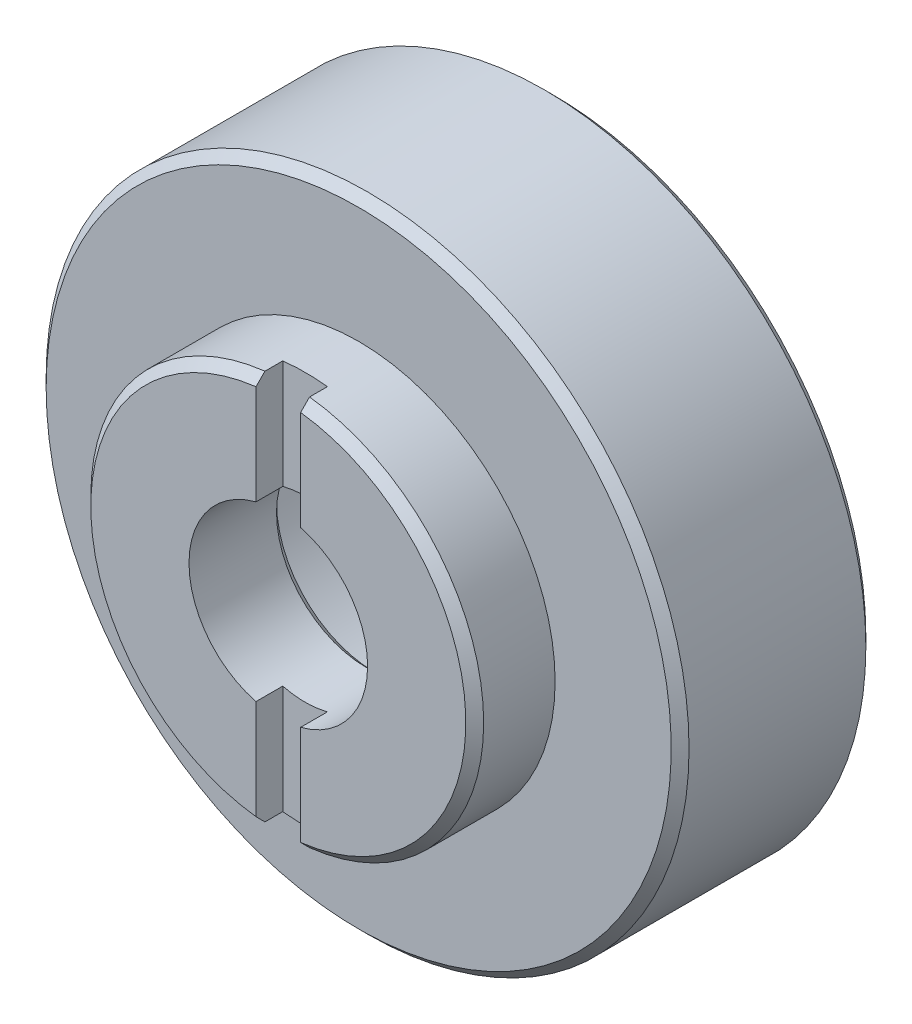
ISO-10303-21;
HEADER;
FILE_DESCRIPTION(('STEP AP214'),'2;1');
FILE_NAME('part.step','',(''),(''),'','','');
FILE_SCHEMA(('AUTOMOTIVE_DESIGN { 1 0 10303 214 1 1 1 1 }'));
ENDSEC;
DATA;
#1=APPLICATION_CONTEXT('core data for automotive mechanical design processes');
#2=APPLICATION_PROTOCOL_DEFINITION('international standard','automotive_design',2000,#1);
#3=PRODUCT_CONTEXT('',#1,'mechanical');
#4=PRODUCT('Part','Part','',(#3));
#5=PRODUCT_RELATED_PRODUCT_CATEGORY('part','',(#4));
#6=PRODUCT_DEFINITION_FORMATION('','',#4);
#7=PRODUCT_DEFINITION_CONTEXT('part definition',#1,'design');
#8=PRODUCT_DEFINITION('design','',#6,#7);
#9=PRODUCT_DEFINITION_SHAPE('','',#8);
#10=(LENGTH_UNIT() NAMED_UNIT(*) SI_UNIT(.MILLI.,.METRE.));
#11=(NAMED_UNIT(*) PLANE_ANGLE_UNIT() SI_UNIT($,.RADIAN.));
#12=(NAMED_UNIT(*) SI_UNIT($,.STERADIAN.) SOLID_ANGLE_UNIT());
#13=UNCERTAINTY_MEASURE_WITH_UNIT(LENGTH_MEASURE(1.E-05),#10,'distance_accuracy_value','');
#14=(GEOMETRIC_REPRESENTATION_CONTEXT(3) GLOBAL_UNCERTAINTY_ASSIGNED_CONTEXT((#13)) GLOBAL_UNIT_ASSIGNED_CONTEXT((#10,
#11,#12)) REPRESENTATION_CONTEXT('',''));
#15=CARTESIAN_POINT('',(0.,0.,0.));
#16=DIRECTION('',(0.,0.,1.));
#17=DIRECTION('',(1.,0.,0.));
#18=AXIS2_PLACEMENT_3D('',#15,#16,#17);
#19=CARTESIAN_POINT('',(0.,0.,0.));
#20=DIRECTION('',(0.,0.,-1.));
#21=DIRECTION('',(1.,0.,0.));
#22=AXIS2_PLACEMENT_3D('',#19,#20,#21);
#23=CONICAL_SURFACE('',#22,10.5,0.785398163397446);
#24=CARTESIAN_POINT('',(1.25,10.9287464971972,-0.5));
#25=CARTESIAN_POINT('',(1.25,10.7609668789126,-0.333307189488323));
#26=CARTESIAN_POINT('',(1.25,10.5931625311196,-0.166639264853283));
#27=CARTESIAN_POINT('',(1.25,10.4253297309965,0.));
#28=(BOUNDED_CURVE() B_SPLINE_CURVE(3,(#24,#25,#26,#27),.UNSPECIFIED.,.F.,
.F.) B_SPLINE_CURVE_WITH_KNOTS((4,4),(0.,0.00070952691315548),
.UNSPECIFIED.) CURVE() GEOMETRIC_REPRESENTATION_ITEM() RATIONAL_B_SPLINE_CURVE((1.,1.,1.,1.)) REPRESENTATION_ITEM(''));
#29=CARTESIAN_POINT('',(1.25,10.9287464971972,-0.5));
#30=VERTEX_POINT('',#29);
#31=CARTESIAN_POINT('',(1.25,10.4253297309965,0.));
#32=VERTEX_POINT('',#31);
#33=EDGE_CURVE('E336',#30,#32,#28,.T.);
#34=ORIENTED_EDGE('',*,*,#33,.T.);
#35=CARTESIAN_POINT('',(0.,0.,0.));
#36=DIRECTION('',(0.,0.,-1.));
#37=DIRECTION('',(-1.,0.,0.));
#38=AXIS2_PLACEMENT_3D('',#35,#36,#37);
#39=CIRCLE('',#38,10.5);
#40=CARTESIAN_POINT('',(1.25,-10.4253297309965,0.));
#41=VERTEX_POINT('',#40);
#42=EDGE_CURVE('E233',#32,#41,#39,.T.);
#43=ORIENTED_EDGE('',*,*,#42,.T.);
#44=CARTESIAN_POINT('',(1.25,-10.4253297309965,0.));
#45=CARTESIAN_POINT('',(1.25,-10.5931625311196,-0.166639264853283));
#46=CARTESIAN_POINT('',(1.25,-10.7609668789126,-0.333307189488323));
#47=CARTESIAN_POINT('',(1.25,-10.9287464971972,-0.5));
#48=(BOUNDED_CURVE() B_SPLINE_CURVE(3,(#44,#45,#46,#47),.UNSPECIFIED.,.F.,
.F.) B_SPLINE_CURVE_WITH_KNOTS((4,4),(0.,0.000709526913155479),
.UNSPECIFIED.) CURVE() GEOMETRIC_REPRESENTATION_ITEM() RATIONAL_B_SPLINE_CURVE((1.,1.,1.,1.)) REPRESENTATION_ITEM(''));
#49=CARTESIAN_POINT('',(1.25,-10.9287464971972,-0.5));
#50=VERTEX_POINT('',#49);
#51=EDGE_CURVE('E198',#41,#50,#48,.T.);
#52=ORIENTED_EDGE('',*,*,#51,.T.);
#53=CARTESIAN_POINT('',(0.,0.,-0.5));
#54=DIRECTION('',(0.,0.,1.));
#55=DIRECTION('',(-1.,0.,0.));
#56=AXIS2_PLACEMENT_3D('',#53,#54,#55);
#57=CIRCLE('',#56,11.);
#58=CARTESIAN_POINT('',(11.,0.,-0.5));
#59=VERTEX_POINT('',#58);
#60=EDGE_CURVE('E191',#50,#59,#57,.T.);
#61=ORIENTED_EDGE('',*,*,#60,.T.);
#62=CARTESIAN_POINT('',(0.,0.,-0.5));
#63=DIRECTION('',(0.,0.,1.));
#64=DIRECTION('',(-1.,0.,0.));
#65=AXIS2_PLACEMENT_3D('',#62,#63,#64);
#66=CIRCLE('',#65,11.);
#67=EDGE_CURVE('E194',#59,#30,#66,.T.);
#68=ORIENTED_EDGE('',*,*,#67,.T.);
#69=EDGE_LOOP('',(#34,#43,#52,#61,#68));
#70=FACE_BOUND('',#69,.T.);
#71=ADVANCED_FACE('F16',(#70),#23,.T.);
#72=CARTESIAN_POINT('',(0.,0.,0.));
#73=DIRECTION('',(0.,0.,-1.));
#74=DIRECTION('',(-1.,0.,0.));
#75=AXIS2_PLACEMENT_3D('',#72,#73,#74);
#76=CONICAL_SURFACE('',#75,10.5,0.785398163397447);
#77=CARTESIAN_POINT('',(-1.25,-10.9287464971972,-0.5));
#78=CARTESIAN_POINT('',(-1.25,-10.7609668789126,-0.333307189488321));
#79=CARTESIAN_POINT('',(-1.25,-10.5931625311196,-0.166639264853283));
#80=CARTESIAN_POINT('',(-1.25,-10.4253297309965,0.));
#81=(BOUNDED_CURVE() B_SPLINE_CURVE(3,(#77,#78,#79,#80),.UNSPECIFIED.,.F.,
.F.) B_SPLINE_CURVE_WITH_KNOTS((4,4),(0.,0.000709526913155476),
.UNSPECIFIED.) CURVE() GEOMETRIC_REPRESENTATION_ITEM() RATIONAL_B_SPLINE_CURVE((1.,1.,1.,1.)) REPRESENTATION_ITEM(''));
#82=CARTESIAN_POINT('',(-1.25,-10.9287464971972,-0.5));
#83=VERTEX_POINT('',#82);
#84=CARTESIAN_POINT('',(-1.25,-10.4253297309965,0.));
#85=VERTEX_POINT('',#84);
#86=EDGE_CURVE('E290',#83,#85,#81,.T.);
#87=ORIENTED_EDGE('',*,*,#86,.T.);
#88=CARTESIAN_POINT('',(0.,0.,0.));
#89=DIRECTION('',(0.,0.,-1.));
#90=DIRECTION('',(-1.,0.,0.));
#91=AXIS2_PLACEMENT_3D('',#88,#89,#90);
#92=CIRCLE('',#91,10.5);
#93=CARTESIAN_POINT('',(-1.25,10.4253297309965,0.));
#94=VERTEX_POINT('',#93);
#95=EDGE_CURVE('E363',#85,#94,#92,.T.);
#96=ORIENTED_EDGE('',*,*,#95,.T.);
#97=CARTESIAN_POINT('',(-1.25,10.4253297309965,0.));
#98=CARTESIAN_POINT('',(-1.25,10.5931625311196,-0.166639264853282));
#99=CARTESIAN_POINT('',(-1.25,10.7609668789126,-0.333307189488321));
#100=CARTESIAN_POINT('',(-1.25,10.9287464971972,-0.5));
#101=(BOUNDED_CURVE() B_SPLINE_CURVE(3,(#97,#98,#99,#100),.UNSPECIFIED.,.F.,
.F.) B_SPLINE_CURVE_WITH_KNOTS((4,4),(0.,0.000709526913155474),
.UNSPECIFIED.) CURVE() GEOMETRIC_REPRESENTATION_ITEM() RATIONAL_B_SPLINE_CURVE((1.,1.,1.,1.)) REPRESENTATION_ITEM(''));
#102=CARTESIAN_POINT('',(-1.25,10.9287464971972,-0.5));
#103=VERTEX_POINT('',#102);
#104=EDGE_CURVE('E318',#94,#103,#101,.T.);
#105=ORIENTED_EDGE('',*,*,#104,.T.);
#106=CARTESIAN_POINT('',(0.,0.,-0.5));
#107=DIRECTION('',(0.,0.,1.));
#108=DIRECTION('',(-1.,0.,0.));
#109=AXIS2_PLACEMENT_3D('',#106,#107,#108);
#110=CIRCLE('',#109,11.);
#111=EDGE_CURVE('E279',#103,#83,#110,.T.);
#112=ORIENTED_EDGE('',*,*,#111,.T.);
#113=EDGE_LOOP('',(#87,#96,#105,#112));
#114=FACE_BOUND('',#113,.T.);
#115=ADVANCED_FACE('F413',(#114),#76,.T.);
#116=CARTESIAN_POINT('',(0.,0.,-4.5));
#117=DIRECTION('',(0.,0.,-1.));
#118=DIRECTION('',(1.,0.,0.));
#119=AXIS2_PLACEMENT_3D('',#116,#117,#118);
#120=CONICAL_SURFACE('',#119,17.5,0.785398163397452);
#121=CARTESIAN_POINT('',(0.,0.,-5.));
#122=DIRECTION('',(0.,0.,1.));
#123=DIRECTION('',(-1.,0.,0.));
#124=AXIS2_PLACEMENT_3D('',#121,#122,#123);
#125=CIRCLE('',#124,18.);
#126=CARTESIAN_POINT('',(-18.,0.,-5.));
#127=VERTEX_POINT('',#126);
#128=CARTESIAN_POINT('',(18.,0.,-5.));
#129=VERTEX_POINT('',#128);
#130=EDGE_CURVE('E252',#127,#129,#125,.T.);
#131=ORIENTED_EDGE('',*,*,#130,.T.);
#132=CARTESIAN_POINT('',(0.,0.,-5.));
#133=DIRECTION('',(0.,0.,1.));
#134=DIRECTION('',(-1.,0.,0.));
#135=AXIS2_PLACEMENT_3D('',#132,#133,#134);
#136=CIRCLE('',#135,18.);
#137=EDGE_CURVE('E256',#129,#127,#136,.T.);
#138=ORIENTED_EDGE('',*,*,#137,.T.);
#139=DIRECTION('',(0.70710678118655,0.,0.707106781186545));
#140=VECTOR('',#139,1.);
#141=CARTESIAN_POINT('',(-17.5,0.,-4.5));
#142=LINE('',#141,#140);
#143=CARTESIAN_POINT('',(-17.5,0.,-4.5));
#144=VERTEX_POINT('',#143);
#145=EDGE_CURVE('E11',#127,#144,#142,.T.);
#146=ORIENTED_EDGE('',*,*,#145,.T.);
#147=CARTESIAN_POINT('',(0.,0.,-4.5));
#148=DIRECTION('',(0.,0.,-1.));
#149=DIRECTION('',(-1.,0.,0.));
#150=AXIS2_PLACEMENT_3D('',#147,#148,#149);
#151=CIRCLE('',#150,17.5);
#152=EDGE_CURVE('E257',#144,#144,#151,.T.);
#153=ORIENTED_EDGE('',*,*,#152,.T.);
#154=ORIENTED_EDGE('',*,*,#145,.F.);
#155=EDGE_LOOP('',(#131,#138,#146,#153,#154));
#156=FACE_BOUND('',#155,.T.);
#157=ADVANCED_FACE('F498',(#156),#120,.T.);
#158=CARTESIAN_POINT('',(0.,0.,-14.9));
#159=DIRECTION('',(0.,0.,1.));
#160=DIRECTION('',(-1.,0.,0.));
#161=AXIS2_PLACEMENT_3D('',#158,#159,#160);
#162=CONICAL_SURFACE('',#161,18.,0.785398163397452);
#163=CARTESIAN_POINT('',(0.,0.,-14.9));
#164=DIRECTION('',(0.,0.,-1.));
#165=DIRECTION('',(1.,0.,0.));
#166=AXIS2_PLACEMENT_3D('',#163,#164,#165);
#167=CIRCLE('',#166,18.);
#168=CARTESIAN_POINT('',(18.,0.,-14.9));
#169=VERTEX_POINT('',#168);
#170=EDGE_CURVE('E345',#169,#169,#167,.T.);
#171=ORIENTED_EDGE('',*,*,#170,.T.);
#172=DIRECTION('',(-0.70710678118655,0.,-0.707106781186545));
#173=VECTOR('',#172,1.);
#174=CARTESIAN_POINT('',(18.,0.,-14.9));
#175=LINE('',#174,#173);
#176=CARTESIAN_POINT('',(17.5,0.,-15.4));
#177=VERTEX_POINT('',#176);
#178=EDGE_CURVE('E27',#169,#177,#175,.T.);
#179=ORIENTED_EDGE('',*,*,#178,.T.);
#180=CARTESIAN_POINT('',(0.,0.,-15.4));
#181=DIRECTION('',(0.,0.,1.));
#182=DIRECTION('',(1.,0.,0.));
#183=AXIS2_PLACEMENT_3D('',#180,#181,#182);
#184=CIRCLE('',#183,17.5);
#185=EDGE_CURVE('E270',#177,#177,#184,.T.);
#186=ORIENTED_EDGE('',*,*,#185,.T.);
#187=ORIENTED_EDGE('',*,*,#178,.F.);
#188=EDGE_LOOP('',(#171,#179,#186,#187));
#189=FACE_BOUND('',#188,.T.);
#190=ADVANCED_FACE('F524',(#189),#162,.T.);
#191=CARTESIAN_POINT('',(0.,0.,-15.4));
#192=DIRECTION('',(0.,0.,-1.));
#193=DIRECTION('',(1.,0.,0.));
#194=AXIS2_PLACEMENT_3D('',#191,#192,#193);
#195=CONICAL_SURFACE('',#194,11.5,0.785398163397445);
#196=CARTESIAN_POINT('',(0.,0.,-14.9));
#197=DIRECTION('',(0.,0.,1.));
#198=DIRECTION('',(1.,0.,0.));
#199=AXIS2_PLACEMENT_3D('',#196,#197,#198);
#200=CIRCLE('',#199,11.);
#201=CARTESIAN_POINT('',(11.,0.,-14.9));
#202=VERTEX_POINT('',#201);
#203=CARTESIAN_POINT('',(-11.,0.,-14.9));
#204=VERTEX_POINT('',#203);
#205=EDGE_CURVE('E228',#202,#204,#200,.T.);
#206=ORIENTED_EDGE('',*,*,#205,.T.);
#207=DIRECTION('',(-0.707106781186545,0.,-0.70710678118655));
#208=VECTOR('',#207,1.);
#209=CARTESIAN_POINT('',(-11.5,0.,-15.4));
#210=LINE('',#209,#208);
#211=CARTESIAN_POINT('',(-11.5,0.,-15.4));
#212=VERTEX_POINT('',#211);
#213=EDGE_CURVE('E282',#204,#212,#210,.T.);
#214=ORIENTED_EDGE('',*,*,#213,.T.);
#215=CARTESIAN_POINT('',(0.,0.,-15.4));
#216=DIRECTION('',(0.,0.,-1.));
#217=DIRECTION('',(1.,0.,0.));
#218=AXIS2_PLACEMENT_3D('',#215,#216,#217);
#219=CIRCLE('',#218,11.5);
#220=CARTESIAN_POINT('',(11.5,0.,-15.4));
#221=VERTEX_POINT('',#220);
#222=EDGE_CURVE('E269',#212,#221,#219,.T.);
#223=ORIENTED_EDGE('',*,*,#222,.T.);
#224=CARTESIAN_POINT('',(0.,0.,-15.4));
#225=DIRECTION('',(0.,0.,-1.));
#226=DIRECTION('',(1.,0.,0.));
#227=AXIS2_PLACEMENT_3D('',#224,#225,#226);
#228=CIRCLE('',#227,11.5);
#229=EDGE_CURVE('E265',#221,#212,#228,.T.);
#230=ORIENTED_EDGE('',*,*,#229,.T.);
#231=ORIENTED_EDGE('',*,*,#213,.F.);
#232=CARTESIAN_POINT('',(0.,0.,-14.9));
#233=DIRECTION('',(0.,0.,1.));
#234=DIRECTION('',(1.,0.,0.));
#235=AXIS2_PLACEMENT_3D('',#232,#233,#234);
#236=CIRCLE('',#235,11.);
#237=EDGE_CURVE('E351',#204,#202,#236,.T.);
#238=ORIENTED_EDGE('',*,*,#237,.T.);
#239=EDGE_LOOP('',(#206,#214,#223,#230,#231,#238));
#240=FACE_BOUND('',#239,.T.);
#241=ADVANCED_FACE('F521',(#240),#195,.F.);
#242=CARTESIAN_POINT('',(0.,0.,-5.4));
#243=DIRECTION('',(0.,0.,-1.));
#244=DIRECTION('',(1.,0.,0.));
#245=AXIS2_PLACEMENT_3D('',#242,#243,#244);
#246=CONICAL_SURFACE('',#245,5.5,0.785398163397444);
#247=CARTESIAN_POINT('',(0.,0.,-4.9));
#248=DIRECTION('',(0.,0.,1.));
#249=DIRECTION('',(1.,0.,0.));
#250=AXIS2_PLACEMENT_3D('',#247,#248,#249);
#251=CIRCLE('',#250,5.);
#252=CARTESIAN_POINT('',(5.,0.,-4.9));
#253=VERTEX_POINT('',#252);
#254=CARTESIAN_POINT('',(-5.,0.,-4.9));
#255=VERTEX_POINT('',#254);
#256=EDGE_CURVE('E251',#253,#255,#251,.T.);
#257=ORIENTED_EDGE('',*,*,#256,.T.);
#258=DIRECTION('',(-0.707106781186544,0.,-0.707106781186551));
#259=VECTOR('',#258,1.);
#260=CARTESIAN_POINT('',(-5.5,0.,-5.4));
#261=LINE('',#260,#259);
#262=CARTESIAN_POINT('',(-5.5,0.,-5.4));
#263=VERTEX_POINT('',#262);
#264=EDGE_CURVE('E297',#255,#263,#261,.T.);
#265=ORIENTED_EDGE('',*,*,#264,.T.);
#266=CARTESIAN_POINT('',(0.,0.,-5.4));
#267=DIRECTION('',(0.,0.,-1.));
#268=DIRECTION('',(1.,0.,0.));
#269=AXIS2_PLACEMENT_3D('',#266,#267,#268);
#270=CIRCLE('',#269,5.5);
#271=CARTESIAN_POINT('',(5.5,0.,-5.4));
#272=VERTEX_POINT('',#271);
#273=EDGE_CURVE('E258',#263,#272,#270,.T.);
#274=ORIENTED_EDGE('',*,*,#273,.T.);
#275=CARTESIAN_POINT('',(0.,0.,-5.4));
#276=DIRECTION('',(0.,0.,-1.));
#277=DIRECTION('',(1.,0.,0.));
#278=AXIS2_PLACEMENT_3D('',#275,#276,#277);
#279=CIRCLE('',#278,5.5);
#280=EDGE_CURVE('E262',#272,#263,#279,.T.);
#281=ORIENTED_EDGE('',*,*,#280,.T.);
#282=ORIENTED_EDGE('',*,*,#264,.F.);
#283=CARTESIAN_POINT('',(0.,0.,-4.9));
#284=DIRECTION('',(0.,0.,1.));
#285=DIRECTION('',(1.,0.,0.));
#286=AXIS2_PLACEMENT_3D('',#283,#284,#285);
#287=CIRCLE('',#286,5.);
#288=EDGE_CURVE('E234',#255,#253,#287,.T.);
#289=ORIENTED_EDGE('',*,*,#288,.T.);
#290=EDGE_LOOP('',(#257,#265,#274,#281,#282,#289));
#291=FACE_BOUND('',#290,.T.);
#292=ADVANCED_FACE('F480',(#291),#246,.F.);
#293=CARTESIAN_POINT('',(0.,0.,-1.5));
#294=DIRECTION('',(0.,0.,-1.));
#295=DIRECTION('',(0.,-1.,0.));
#296=AXIS2_PLACEMENT_3D('',#293,#294,#295);
#297=PLANE('',#296);
#298=DIRECTION('',(0.,1.,0.));
#299=VECTOR('',#298,1.);
#300=CARTESIAN_POINT('',(-1.25,-10.9287464971972,-1.5));
#301=LINE('',#300,#299);
#302=CARTESIAN_POINT('',(-1.25,-10.9287464971972,-1.5));
#303=VERTEX_POINT('',#302);
#304=CARTESIAN_POINT('',(-1.25,-4.84122918275927,-1.5));
#305=VERTEX_POINT('',#304);
#306=EDGE_CURVE('E323',#303,#305,#301,.T.);
#307=ORIENTED_EDGE('',*,*,#306,.F.);
#308=CARTESIAN_POINT('',(0.,0.,-1.5));
#309=DIRECTION('',(0.,0.,1.));
#310=DIRECTION('',(-1.,0.,0.));
#311=AXIS2_PLACEMENT_3D('',#308,#309,#310);
#312=CIRCLE('',#311,11.);
#313=CARTESIAN_POINT('',(1.25,-10.9287464971972,-1.5));
#314=VERTEX_POINT('',#313);
#315=EDGE_CURVE('E349',#303,#314,#312,.T.);
#316=ORIENTED_EDGE('',*,*,#315,.T.);
#317=DIRECTION('',(0.,-1.,0.));
#318=VECTOR('',#317,1.);
#319=CARTESIAN_POINT('',(1.25,-4.84122918275927,-1.5));
#320=LINE('',#319,#318);
#321=CARTESIAN_POINT('',(1.25,-4.84122918275927,-1.5));
#322=VERTEX_POINT('',#321);
#323=EDGE_CURVE('E287',#322,#314,#320,.T.);
#324=ORIENTED_EDGE('',*,*,#323,.F.);
#325=CARTESIAN_POINT('',(0.,0.,-1.5));
#326=DIRECTION('',(0.,0.,1.));
#327=DIRECTION('',(-1.,0.,0.));
#328=AXIS2_PLACEMENT_3D('',#325,#326,#327);
#329=CIRCLE('',#328,5.);
#330=EDGE_CURVE('E286',#305,#322,#329,.T.);
#331=ORIENTED_EDGE('',*,*,#330,.F.);
#332=EDGE_LOOP('',(#307,#316,#324,#331));
#333=FACE_BOUND('',#332,.T.);
#334=ADVANCED_FACE('F403',(#333),#297,.F.);
#335=CARTESIAN_POINT('',(1.25,-4.84122918275927,-1.5));
#336=DIRECTION('',(-1.,0.,0.));
#337=DIRECTION('',(0.,0.,1.));
#338=AXIS2_PLACEMENT_3D('',#335,#336,#337);
#339=PLANE('',#338);
#340=DIRECTION('',(0.,-1.,0.));
#341=VECTOR('',#340,1.);
#342=CARTESIAN_POINT('',(1.25,-4.84122918275927,0.));
#343=LINE('',#342,#341);
#344=CARTESIAN_POINT('',(1.25,-4.84122918275927,0.));
#345=VERTEX_POINT('',#344);
#346=EDGE_CURVE('E242',#345,#41,#343,.T.);
#347=ORIENTED_EDGE('',*,*,#346,.F.);
#348=DIRECTION('',(0.,0.,1.));
#349=VECTOR('',#348,1.);
#350=CARTESIAN_POINT('',(1.25,-4.84122918275927,-1.5));
#351=LINE('',#350,#349);
#352=EDGE_CURVE('E283',#322,#345,#351,.T.);
#353=ORIENTED_EDGE('',*,*,#352,.F.);
#354=ORIENTED_EDGE('',*,*,#323,.T.);
#355=DIRECTION('',(0.,0.,-1.));
#356=VECTOR('',#355,1.);
#357=CARTESIAN_POINT('',(1.25,-10.9287464971972,-1.5));
#358=LINE('',#357,#356);
#359=EDGE_CURVE('E203',#50,#314,#358,.T.);
#360=ORIENTED_EDGE('',*,*,#359,.F.);
#361=ORIENTED_EDGE('',*,*,#51,.F.);
#362=EDGE_LOOP('',(#347,#353,#354,#360,#361));
#363=FACE_BOUND('',#362,.T.);
#364=ADVANCED_FACE('F398',(#363),#339,.T.);
#365=CARTESIAN_POINT('',(-1.25,-4.84122918275927,-1.5));
#366=DIRECTION('',(1.,0.,0.));
#367=DIRECTION('',(0.,0.,1.));
#368=AXIS2_PLACEMENT_3D('',#365,#366,#367);
#369=PLANE('',#368);
#370=DIRECTION('',(0.,0.,1.));
#371=VECTOR('',#370,1.);
#372=CARTESIAN_POINT('',(-1.25,-10.9287464971972,-1.5));
#373=LINE('',#372,#371);
#374=EDGE_CURVE('E346',#303,#83,#373,.T.);
#375=ORIENTED_EDGE('',*,*,#374,.F.);
#376=ORIENTED_EDGE('',*,*,#306,.T.);
#377=DIRECTION('',(0.,0.,1.));
#378=VECTOR('',#377,1.);
#379=CARTESIAN_POINT('',(-1.25,-4.84122918275927,-1.5));
#380=LINE('',#379,#378);
#381=CARTESIAN_POINT('',(-1.25,-4.84122918275927,0.));
#382=VERTEX_POINT('',#381);
#383=EDGE_CURVE('E339',#305,#382,#380,.T.);
#384=ORIENTED_EDGE('',*,*,#383,.T.);
#385=DIRECTION('',(0.,1.,0.));
#386=VECTOR('',#385,1.);
#387=CARTESIAN_POINT('',(-1.25,-10.4253297309965,0.));
#388=LINE('',#387,#386);
#389=EDGE_CURVE('E237',#85,#382,#388,.T.);
#390=ORIENTED_EDGE('',*,*,#389,.F.);
#391=ORIENTED_EDGE('',*,*,#86,.F.);
#392=EDGE_LOOP('',(#375,#376,#384,#390,#391));
#393=FACE_BOUND('',#392,.T.);
#394=ADVANCED_FACE('F408',(#393),#369,.T.);
#395=CARTESIAN_POINT('',(0.,0.,-1.5));
#396=DIRECTION('',(0.,0.,-1.));
#397=DIRECTION('',(0.,-1.,0.));
#398=AXIS2_PLACEMENT_3D('',#395,#396,#397);
#399=PLANE('',#398);
#400=DIRECTION('',(0.,-1.,0.));
#401=VECTOR('',#400,1.);
#402=CARTESIAN_POINT('',(1.25,10.9287464971972,-1.5));
#403=LINE('',#402,#401);
#404=CARTESIAN_POINT('',(1.25,10.9287464971972,-1.5));
#405=VERTEX_POINT('',#404);
#406=CARTESIAN_POINT('',(1.25,4.84122918275927,-1.5));
#407=VERTEX_POINT('',#406);
#408=EDGE_CURVE('E342',#405,#407,#403,.T.);
#409=ORIENTED_EDGE('',*,*,#408,.F.);
#410=CARTESIAN_POINT('',(0.,0.,-1.5));
#411=DIRECTION('',(0.,0.,1.));
#412=DIRECTION('',(-1.,0.,0.));
#413=AXIS2_PLACEMENT_3D('',#410,#411,#412);
#414=CIRCLE('',#413,11.);
#415=CARTESIAN_POINT('',(-1.25,10.9287464971972,-1.5));
#416=VERTEX_POINT('',#415);
#417=EDGE_CURVE('E224',#405,#416,#414,.T.);
#418=ORIENTED_EDGE('',*,*,#417,.T.);
#419=DIRECTION('',(0.,1.,0.));
#420=VECTOR('',#419,1.);
#421=CARTESIAN_POINT('',(-1.25,4.84122918275927,-1.5));
#422=LINE('',#421,#420);
#423=CARTESIAN_POINT('',(-1.25,4.84122918275927,-1.5));
#424=VERTEX_POINT('',#423);
#425=EDGE_CURVE('E324',#424,#416,#422,.T.);
#426=ORIENTED_EDGE('',*,*,#425,.F.);
#427=CARTESIAN_POINT('',(0.,0.,-1.5));
#428=DIRECTION('',(0.,0.,1.));
#429=DIRECTION('',(-1.,0.,0.));
#430=AXIS2_PLACEMENT_3D('',#427,#428,#429);
#431=CIRCLE('',#430,5.);
#432=EDGE_CURVE('E303',#407,#424,#431,.T.);
#433=ORIENTED_EDGE('',*,*,#432,.F.);
#434=EDGE_LOOP('',(#409,#418,#426,#433));
#435=FACE_BOUND('',#434,.T.);
#436=ADVANCED_FACE('F421',(#435),#399,.F.);
#437=CARTESIAN_POINT('',(-1.25,10.9409689664164,-1.5));
#438=DIRECTION('',(1.,0.,0.));
#439=DIRECTION('',(0.,0.,1.));
#440=AXIS2_PLACEMENT_3D('',#437,#438,#439);
#441=PLANE('',#440);
#442=DIRECTION('',(0.,1.,0.));
#443=VECTOR('',#442,1.);
#444=CARTESIAN_POINT('',(-1.25,4.84122918275927,0.));
#445=LINE('',#444,#443);
#446=CARTESIAN_POINT('',(-1.25,4.84122918275927,0.));
#447=VERTEX_POINT('',#446);
#448=EDGE_CURVE('E331',#447,#94,#445,.T.);
#449=ORIENTED_EDGE('',*,*,#448,.F.);
#450=DIRECTION('',(0.,0.,1.));
#451=VECTOR('',#450,1.);
#452=CARTESIAN_POINT('',(-1.25,4.84122918275927,-1.5));
#453=LINE('',#452,#451);
#454=EDGE_CURVE('E307',#424,#447,#453,.T.);
#455=ORIENTED_EDGE('',*,*,#454,.F.);
#456=ORIENTED_EDGE('',*,*,#425,.T.);
#457=DIRECTION('',(0.,0.,-1.));
#458=VECTOR('',#457,1.);
#459=CARTESIAN_POINT('',(-1.25,10.9287464971972,-1.5));
#460=LINE('',#459,#458);
#461=EDGE_CURVE('E230',#103,#416,#460,.T.);
#462=ORIENTED_EDGE('',*,*,#461,.F.);
#463=ORIENTED_EDGE('',*,*,#104,.F.);
#464=EDGE_LOOP('',(#449,#455,#456,#462,#463));
#465=FACE_BOUND('',#464,.T.);
#466=ADVANCED_FACE('F18',(#465),#441,.T.);
#467=CARTESIAN_POINT('',(1.25,10.9409689664164,-1.5));
#468=DIRECTION('',(-1.,0.,0.));
#469=DIRECTION('',(0.,0.,1.));
#470=AXIS2_PLACEMENT_3D('',#467,#468,#469);
#471=PLANE('',#470);
#472=DIRECTION('',(0.,0.,1.));
#473=VECTOR('',#472,1.);
#474=CARTESIAN_POINT('',(1.25,10.9287464971972,-1.5));
#475=LINE('',#474,#473);
#476=EDGE_CURVE('E217',#405,#30,#475,.T.);
#477=ORIENTED_EDGE('',*,*,#476,.F.);
#478=ORIENTED_EDGE('',*,*,#408,.T.);
#479=DIRECTION('',(0.,0.,1.));
#480=VECTOR('',#479,1.);
#481=CARTESIAN_POINT('',(1.25,4.84122918275927,-1.5));
#482=LINE('',#481,#480);
#483=CARTESIAN_POINT('',(1.25,4.84122918275927,0.));
#484=VERTEX_POINT('',#483);
#485=EDGE_CURVE('E308',#407,#484,#482,.T.);
#486=ORIENTED_EDGE('',*,*,#485,.T.);
#487=DIRECTION('',(0.,-1.,0.));
#488=VECTOR('',#487,1.);
#489=CARTESIAN_POINT('',(1.25,10.4253297309965,0.));
#490=LINE('',#489,#488);
#491=EDGE_CURVE('E162',#32,#484,#490,.T.);
#492=ORIENTED_EDGE('',*,*,#491,.F.);
#493=ORIENTED_EDGE('',*,*,#33,.F.);
#494=EDGE_LOOP('',(#477,#478,#486,#492,#493));
#495=FACE_BOUND('',#494,.T.);
#496=ADVANCED_FACE('F424',(#495),#471,.T.);
#497=CARTESIAN_POINT('',(0.,0.,0.));
#498=DIRECTION('',(0.,0.,-1.));
#499=DIRECTION('',(-1.,0.,0.));
#500=AXIS2_PLACEMENT_3D('',#497,#498,#499);
#501=CYLINDRICAL_SURFACE('',#500,18.);
#502=ORIENTED_EDGE('',*,*,#130,.F.);
#503=ORIENTED_EDGE('',*,*,#137,.F.);
#504=DIRECTION('',(0.,0.,-1.));
#505=VECTOR('',#504,1.);
#506=CARTESIAN_POINT('',(18.,0.,0.));
#507=LINE('',#506,#505);
#508=EDGE_CURVE('E20',#129,#169,#507,.T.);
#509=ORIENTED_EDGE('',*,*,#508,.T.);
#510=ORIENTED_EDGE('',*,*,#170,.F.);
#511=ORIENTED_EDGE('',*,*,#508,.F.);
#512=EDGE_LOOP('',(#502,#503,#509,#510,#511));
#513=FACE_BOUND('',#512,.T.);
#514=ADVANCED_FACE('F510',(#513),#501,.T.);
#515=CARTESIAN_POINT('',(-18.,0.,-4.5));
#516=DIRECTION('',(0.,0.,-1.));
#517=DIRECTION('',(0.,-1.,0.));
#518=AXIS2_PLACEMENT_3D('',#515,#516,#517);
#519=PLANE('',#518);
#520=CARTESIAN_POINT('',(0.,0.,-4.5));
#521=DIRECTION('',(0.,0.,-1.));
#522=DIRECTION('',(-1.,0.,0.));
#523=AXIS2_PLACEMENT_3D('',#520,#521,#522);
#524=CIRCLE('',#523,11.);
#525=CARTESIAN_POINT('',(-11.,0.,-4.5));
#526=VERTEX_POINT('',#525);
#527=CARTESIAN_POINT('',(11.,0.,-4.5));
#528=VERTEX_POINT('',#527);
#529=EDGE_CURVE('E213',#526,#528,#524,.T.);
#530=ORIENTED_EDGE('',*,*,#529,.T.);
#531=CARTESIAN_POINT('',(0.,0.,-4.5));
#532=DIRECTION('',(0.,0.,-1.));
#533=DIRECTION('',(-1.,0.,0.));
#534=AXIS2_PLACEMENT_3D('',#531,#532,#533);
#535=CIRCLE('',#534,11.);
#536=EDGE_CURVE('E204',#528,#526,#535,.T.);
#537=ORIENTED_EDGE('',*,*,#536,.T.);
#538=EDGE_LOOP('',(#530,#537));
#539=FACE_BOUND('',#538,.T.);
#540=ORIENTED_EDGE('',*,*,#152,.F.);
#541=EDGE_LOOP('',(#540));
#542=FACE_BOUND('',#541,.T.);
#543=ADVANCED_FACE('F508',(#539,#542),#519,.F.);
#544=CARTESIAN_POINT('',(0.,0.,0.));
#545=DIRECTION('',(0.,0.,-1.));
#546=DIRECTION('',(-1.,0.,0.));
#547=AXIS2_PLACEMENT_3D('',#544,#545,#546);
#548=CYLINDRICAL_SURFACE('',#547,11.);
#549=ORIENTED_EDGE('',*,*,#461,.T.);
#550=ORIENTED_EDGE('',*,*,#417,.F.);
#551=ORIENTED_EDGE('',*,*,#476,.T.);
#552=ORIENTED_EDGE('',*,*,#67,.F.);
#553=DIRECTION('',(0.,0.,-1.));
#554=VECTOR('',#553,1.);
#555=CARTESIAN_POINT('',(11.,0.,0.));
#556=LINE('',#555,#554);
#557=EDGE_CURVE('E207',#59,#528,#556,.T.);
#558=ORIENTED_EDGE('',*,*,#557,.T.);
#559=ORIENTED_EDGE('',*,*,#529,.F.);
#560=ORIENTED_EDGE('',*,*,#536,.F.);
#561=ORIENTED_EDGE('',*,*,#557,.F.);
#562=ORIENTED_EDGE('',*,*,#60,.F.);
#563=ORIENTED_EDGE('',*,*,#359,.T.);
#564=ORIENTED_EDGE('',*,*,#315,.F.);
#565=ORIENTED_EDGE('',*,*,#374,.T.);
#566=ORIENTED_EDGE('',*,*,#111,.F.);
#567=EDGE_LOOP('',(#549,#550,#551,#552,#558,#559,#560,#561,#562,#563,#564,#565,#566));
#568=FACE_BOUND('',#567,.T.);
#569=ADVANCED_FACE('F209',(#568),#548,.T.);
#570=CARTESIAN_POINT('',(-11.,0.,0.));
#571=DIRECTION('',(0.,0.,-1.));
#572=DIRECTION('',(0.,-1.,0.));
#573=AXIS2_PLACEMENT_3D('',#570,#571,#572);
#574=PLANE('',#573);
#575=ORIENTED_EDGE('',*,*,#491,.T.);
#576=CARTESIAN_POINT('',(0.,0.,0.));
#577=DIRECTION('',(0.,0.,-1.));
#578=DIRECTION('',(-1.,0.,0.));
#579=AXIS2_PLACEMENT_3D('',#576,#577,#578);
#580=CIRCLE('',#579,5.);
#581=CARTESIAN_POINT('',(5.,0.,0.));
#582=VERTEX_POINT('',#581);
#583=EDGE_CURVE('E250',#484,#582,#580,.T.);
#584=ORIENTED_EDGE('',*,*,#583,.T.);
#585=CARTESIAN_POINT('',(0.,0.,0.));
#586=DIRECTION('',(0.,0.,-1.));
#587=DIRECTION('',(-1.,0.,0.));
#588=AXIS2_PLACEMENT_3D('',#585,#586,#587);
#589=CIRCLE('',#588,5.);
#590=EDGE_CURVE('E174',#582,#345,#589,.T.);
#591=ORIENTED_EDGE('',*,*,#590,.T.);
#592=ORIENTED_EDGE('',*,*,#346,.T.);
#593=ORIENTED_EDGE('',*,*,#42,.F.);
#594=EDGE_LOOP('',(#575,#584,#591,#592,#593));
#595=FACE_BOUND('',#594,.T.);
#596=ADVANCED_FACE('F395',(#595),#574,.F.);
#597=CARTESIAN_POINT('',(0.,0.,0.));
#598=DIRECTION('',(0.,0.,-1.));
#599=DIRECTION('',(-1.,0.,0.));
#600=AXIS2_PLACEMENT_3D('',#597,#598,#599);
#601=CYLINDRICAL_SURFACE('',#600,5.);
#602=ORIENTED_EDGE('',*,*,#256,.F.);
#603=DIRECTION('',(0.,0.,1.));
#604=VECTOR('',#603,1.);
#605=CARTESIAN_POINT('',(5.,0.,0.));
#606=LINE('',#605,#604);
#607=EDGE_CURVE('E246',#253,#582,#606,.T.);
#608=ORIENTED_EDGE('',*,*,#607,.T.);
#609=ORIENTED_EDGE('',*,*,#583,.F.);
#610=ORIENTED_EDGE('',*,*,#485,.F.);
#611=ORIENTED_EDGE('',*,*,#432,.T.);
#612=ORIENTED_EDGE('',*,*,#454,.T.);
#613=CARTESIAN_POINT('',(0.,0.,0.));
#614=DIRECTION('',(0.,0.,-1.));
#615=DIRECTION('',(-1.,0.,0.));
#616=AXIS2_PLACEMENT_3D('',#613,#614,#615);
#617=CIRCLE('',#616,5.);
#618=EDGE_CURVE('E241',#382,#447,#617,.T.);
#619=ORIENTED_EDGE('',*,*,#618,.F.);
#620=ORIENTED_EDGE('',*,*,#383,.F.);
#621=ORIENTED_EDGE('',*,*,#330,.T.);
#622=ORIENTED_EDGE('',*,*,#352,.T.);
#623=ORIENTED_EDGE('',*,*,#590,.F.);
#624=ORIENTED_EDGE('',*,*,#607,.F.);
#625=ORIENTED_EDGE('',*,*,#288,.F.);
#626=EDGE_LOOP('',(#602,#608,#609,#610,#611,#612,#619,#620,#621,#622,#623,#624,#625));
#627=FACE_BOUND('',#626,.T.);
#628=ADVANCED_FACE('F445',(#627),#601,.F.);
#629=CARTESIAN_POINT('',(-11.,0.,-5.4));
#630=DIRECTION('',(0.,0.,1.));
#631=DIRECTION('',(1.,0.,0.));
#632=AXIS2_PLACEMENT_3D('',#629,#630,#631);
#633=PLANE('',#632);
#634=ORIENTED_EDGE('',*,*,#280,.F.);
#635=ORIENTED_EDGE('',*,*,#273,.F.);
#636=EDGE_LOOP('',(#634,#635));
#637=FACE_BOUND('',#636,.T.);
#638=CARTESIAN_POINT('',(0.,0.,-5.4));
#639=DIRECTION('',(0.,0.,-1.));
#640=DIRECTION('',(-1.,0.,0.));
#641=AXIS2_PLACEMENT_3D('',#638,#639,#640);
#642=CIRCLE('',#641,11.);
#643=CARTESIAN_POINT('',(-11.,0.,-5.4));
#644=VERTEX_POINT('',#643);
#645=CARTESIAN_POINT('',(11.,0.,-5.4));
#646=VERTEX_POINT('',#645);
#647=EDGE_CURVE('E309',#644,#646,#642,.T.);
#648=ORIENTED_EDGE('',*,*,#647,.T.);
#649=CARTESIAN_POINT('',(0.,0.,-5.4));
#650=DIRECTION('',(0.,0.,-1.));
#651=DIRECTION('',(-1.,0.,0.));
#652=AXIS2_PLACEMENT_3D('',#649,#650,#651);
#653=CIRCLE('',#652,11.);
#654=EDGE_CURVE('E312',#646,#644,#653,.T.);
#655=ORIENTED_EDGE('',*,*,#654,.T.);
#656=EDGE_LOOP('',(#648,#655));
#657=FACE_BOUND('',#656,.T.);
#658=ADVANCED_FACE('F458',(#637,#657),#633,.F.);
#659=CARTESIAN_POINT('',(0.,0.,0.));
#660=DIRECTION('',(0.,0.,-1.));
#661=DIRECTION('',(-1.,0.,0.));
#662=AXIS2_PLACEMENT_3D('',#659,#660,#661);
#663=CYLINDRICAL_SURFACE('',#662,11.);
#664=ORIENTED_EDGE('',*,*,#205,.F.);
#665=DIRECTION('',(0.,0.,1.));
#666=VECTOR('',#665,1.);
#667=CARTESIAN_POINT('',(11.,0.,0.));
#668=LINE('',#667,#666);
#669=EDGE_CURVE('E313',#202,#646,#668,.T.);
#670=ORIENTED_EDGE('',*,*,#669,.T.);
#671=ORIENTED_EDGE('',*,*,#647,.F.);
#672=ORIENTED_EDGE('',*,*,#654,.F.);
#673=ORIENTED_EDGE('',*,*,#669,.F.);
#674=ORIENTED_EDGE('',*,*,#237,.F.);
#675=EDGE_LOOP('',(#664,#670,#671,#672,#673,#674));
#676=FACE_BOUND('',#675,.T.);
#677=ADVANCED_FACE('F462',(#676),#663,.F.);
#678=CARTESIAN_POINT('',(-18.,0.,-15.4));
#679=DIRECTION('',(0.,0.,1.));
#680=DIRECTION('',(1.,0.,0.));
#681=AXIS2_PLACEMENT_3D('',#678,#679,#680);
#682=PLANE('',#681);
#683=ORIENTED_EDGE('',*,*,#229,.F.);
#684=ORIENTED_EDGE('',*,*,#222,.F.);
#685=EDGE_LOOP('',(#683,#684));
#686=FACE_BOUND('',#685,.T.);
#687=ORIENTED_EDGE('',*,*,#185,.F.);
#688=EDGE_LOOP('',(#687));
#689=FACE_BOUND('',#688,.T.);
#690=ADVANCED_FACE('F489',(#686,#689),#682,.F.);
#691=CARTESIAN_POINT('',(-11.,0.,0.));
#692=DIRECTION('',(0.,0.,-1.));
#693=DIRECTION('',(0.,-1.,0.));
#694=AXIS2_PLACEMENT_3D('',#691,#692,#693);
#695=PLANE('',#694);
#696=ORIENTED_EDGE('',*,*,#389,.T.);
#697=ORIENTED_EDGE('',*,*,#618,.T.);
#698=ORIENTED_EDGE('',*,*,#448,.T.);
#699=ORIENTED_EDGE('',*,*,#95,.F.);
#700=EDGE_LOOP('',(#696,#697,#698,#699));
#701=FACE_BOUND('',#700,.T.);
#702=ADVANCED_FACE('F442',(#701),#695,.F.);
#703=CLOSED_SHELL('',(#71,#115,#157,#190,#241,#292,#334,#364,#394,#436,#466,#496,#514,#543,#569,
#596,#628,#658,#677,#690,#702));
#704=MANIFOLD_SOLID_BREP('B1',#703);
#705=ADVANCED_BREP_SHAPE_REPRESENTATION('',(#18,#704),#14);
#706=SHAPE_DEFINITION_REPRESENTATION(#9,#705);
ENDSEC;
END-ISO-10303-21;
